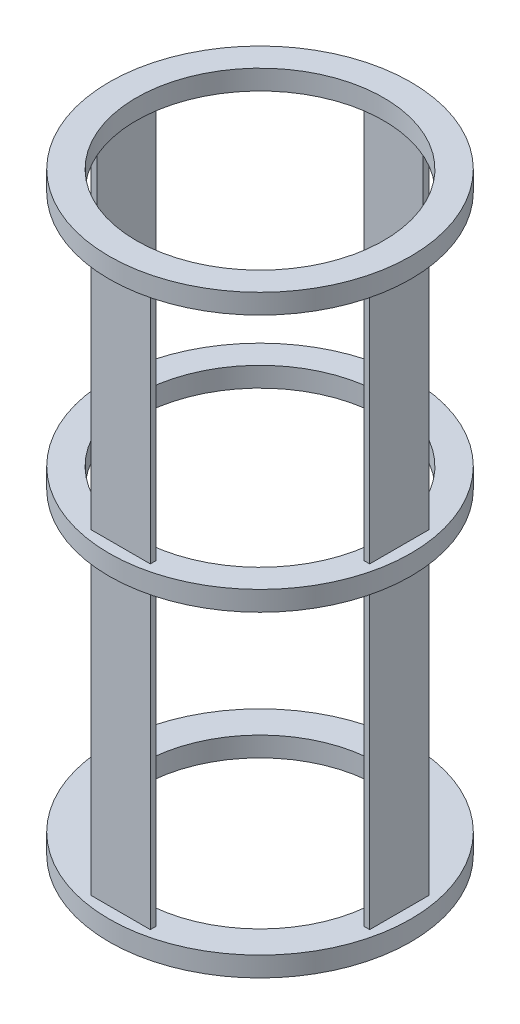
ISO-10303-21;
HEADER;
FILE_DESCRIPTION(('STEP AP214'),'2;1');
FILE_NAME('part.step','',(''),(''),'','','');
FILE_SCHEMA(('AUTOMOTIVE_DESIGN { 1 0 10303 214 1 1 1 1 }'));
ENDSEC;
DATA;
#1=APPLICATION_CONTEXT('core data for automotive mechanical design processes');
#2=APPLICATION_PROTOCOL_DEFINITION('international standard','automotive_design',2000,#1);
#3=PRODUCT_CONTEXT('',#1,'mechanical');
#4=PRODUCT('Part','Part','',(#3));
#5=PRODUCT_RELATED_PRODUCT_CATEGORY('part','',(#4));
#6=PRODUCT_DEFINITION_FORMATION('','',#4);
#7=PRODUCT_DEFINITION_CONTEXT('part definition',#1,'design');
#8=PRODUCT_DEFINITION('design','',#6,#7);
#9=PRODUCT_DEFINITION_SHAPE('','',#8);
#10=(LENGTH_UNIT() NAMED_UNIT(*) SI_UNIT(.MILLI.,.METRE.));
#11=(NAMED_UNIT(*) PLANE_ANGLE_UNIT() SI_UNIT($,.RADIAN.));
#12=(NAMED_UNIT(*) SI_UNIT($,.STERADIAN.) SOLID_ANGLE_UNIT());
#13=UNCERTAINTY_MEASURE_WITH_UNIT(LENGTH_MEASURE(1.E-05),#10,'distance_accuracy_value','');
#14=(GEOMETRIC_REPRESENTATION_CONTEXT(3) GLOBAL_UNCERTAINTY_ASSIGNED_CONTEXT((#13)) GLOBAL_UNIT_ASSIGNED_CONTEXT((#10,
#11,#12)) REPRESENTATION_CONTEXT('',''));
#15=CARTESIAN_POINT('',(0.,0.,0.));
#16=DIRECTION('',(0.,0.,1.));
#17=DIRECTION('',(1.,0.,0.));
#18=AXIS2_PLACEMENT_3D('',#15,#16,#17);
#19=CARTESIAN_POINT('',(70.4201675658329,300.,-15.0000000000007));
#20=DIRECTION('',(-1.,0.,0.));
#21=DIRECTION('',(0.,0.,1.));
#22=AXIS2_PLACEMENT_3D('',#19,#20,#21);
#23=PLANE('',#22);
#24=DIRECTION('',(0.,0.,-1.));
#25=VECTOR('',#24,1.);
#26=CARTESIAN_POINT('',(70.4201675658329,290.,-15.0000000000007));
#27=LINE('',#26,#25);
#28=CARTESIAN_POINT('',(70.4201675658332,290.,14.9999999999993));
#29=VERTEX_POINT('',#28);
#30=CARTESIAN_POINT('',(70.4201675658329,290.,-15.0000000000007));
#31=VERTEX_POINT('',#30);
#32=EDGE_CURVE('E57',#29,#31,#27,.T.);
#33=ORIENTED_EDGE('',*,*,#32,.F.);
#34=DIRECTION('',(0.,-1.,0.));
#35=VECTOR('',#34,1.);
#36=CARTESIAN_POINT('',(70.4201675658332,300.,14.9999999999993));
#37=LINE('',#36,#35);
#38=CARTESIAN_POINT('',(70.4201675658332,170.,14.9999999999993));
#39=VERTEX_POINT('',#38);
#40=EDGE_CURVE('E484',#29,#39,#37,.T.);
#41=ORIENTED_EDGE('',*,*,#40,.T.);
#42=DIRECTION('',(0.,0.,-1.));
#43=VECTOR('',#42,1.);
#44=CARTESIAN_POINT('',(70.4201675658329,170.,-15.0000000000007));
#45=LINE('',#44,#43);
#46=CARTESIAN_POINT('',(70.4201675658329,170.,-15.0000000000007));
#47=VERTEX_POINT('',#46);
#48=EDGE_CURVE('E50',#39,#47,#45,.T.);
#49=ORIENTED_EDGE('',*,*,#48,.T.);
#50=DIRECTION('',(0.,-1.,0.));
#51=VECTOR('',#50,1.);
#52=CARTESIAN_POINT('',(70.4201675658329,300.,-15.0000000000007));
#53=LINE('',#52,#51);
#54=EDGE_CURVE('E480',#31,#47,#53,.T.);
#55=ORIENTED_EDGE('',*,*,#54,.F.);
#56=EDGE_LOOP('',(#33,#41,#49,#55));
#57=FACE_BOUND('',#56,.T.);
#58=ADVANCED_FACE('F41',(#57),#23,.F.);
#59=CARTESIAN_POINT('',(70.4201675658332,300.,14.9999999999993));
#60=DIRECTION('',(0.,0.,-1.));
#61=DIRECTION('',(-1.,0.,0.));
#62=AXIS2_PLACEMENT_3D('',#59,#60,#61);
#63=PLANE('',#62);
#64=DIRECTION('',(1.,0.,0.));
#65=VECTOR('',#64,1.);
#66=CARTESIAN_POINT('',(70.4201675658332,290.,14.9999999999993));
#67=LINE('',#66,#65);
#68=CARTESIAN_POINT('',(67.4201675658332,290.,14.9999999999993));
#69=VERTEX_POINT('',#68);
#70=EDGE_CURVE('E64',#69,#29,#67,.T.);
#71=ORIENTED_EDGE('',*,*,#70,.F.);
#72=DIRECTION('',(0.,-1.,0.));
#73=VECTOR('',#72,1.);
#74=CARTESIAN_POINT('',(67.4201675658332,300.,14.9999999999993));
#75=LINE('',#74,#73);
#76=CARTESIAN_POINT('',(67.4201675658332,170.,14.9999999999993));
#77=VERTEX_POINT('',#76);
#78=EDGE_CURVE('E488',#69,#77,#75,.T.);
#79=ORIENTED_EDGE('',*,*,#78,.T.);
#80=DIRECTION('',(1.,0.,0.));
#81=VECTOR('',#80,1.);
#82=CARTESIAN_POINT('',(70.4201675658332,170.,14.9999999999993));
#83=LINE('',#82,#81);
#84=EDGE_CURVE('E406',#77,#39,#83,.T.);
#85=ORIENTED_EDGE('',*,*,#84,.T.);
#86=ORIENTED_EDGE('',*,*,#40,.F.);
#87=EDGE_LOOP('',(#71,#79,#85,#86));
#88=FACE_BOUND('',#87,.T.);
#89=ADVANCED_FACE('F613',(#88),#63,.F.);
#90=CARTESIAN_POINT('',(67.4201675658332,300.,14.9999999999993));
#91=DIRECTION('',(1.,0.,0.));
#92=DIRECTION('',(0.,0.,-1.));
#93=AXIS2_PLACEMENT_3D('',#90,#91,#92);
#94=PLANE('',#93);
#95=DIRECTION('',(0.,0.,1.));
#96=VECTOR('',#95,1.);
#97=CARTESIAN_POINT('',(67.4201675658332,290.,14.9999999999993));
#98=LINE('',#97,#96);
#99=CARTESIAN_POINT('',(67.4201675658329,290.,-15.0000000000007));
#100=VERTEX_POINT('',#99);
#101=EDGE_CURVE('E322',#100,#69,#98,.T.);
#102=ORIENTED_EDGE('',*,*,#101,.F.);
#103=DIRECTION('',(0.,-1.,0.));
#104=VECTOR('',#103,1.);
#105=CARTESIAN_POINT('',(67.4201675658329,300.,-15.0000000000007));
#106=LINE('',#105,#104);
#107=CARTESIAN_POINT('',(67.4201675658328,170.,-15.0000000000007));
#108=VERTEX_POINT('',#107);
#109=EDGE_CURVE('E492',#100,#108,#106,.T.);
#110=ORIENTED_EDGE('',*,*,#109,.T.);
#111=DIRECTION('',(0.,0.,1.));
#112=VECTOR('',#111,1.);
#113=CARTESIAN_POINT('',(67.4201675658332,170.,14.9999999999993));
#114=LINE('',#113,#112);
#115=EDGE_CURVE('E410',#108,#77,#114,.T.);
#116=ORIENTED_EDGE('',*,*,#115,.T.);
#117=ORIENTED_EDGE('',*,*,#78,.F.);
#118=EDGE_LOOP('',(#102,#110,#116,#117));
#119=FACE_BOUND('',#118,.T.);
#120=ADVANCED_FACE('F616',(#119),#94,.F.);
#121=CARTESIAN_POINT('',(67.4201675658329,300.,-15.0000000000007));
#122=DIRECTION('',(0.,0.,1.));
#123=DIRECTION('',(1.,0.,0.));
#124=AXIS2_PLACEMENT_3D('',#121,#122,#123);
#125=PLANE('',#124);
#126=DIRECTION('',(-1.,0.,0.));
#127=VECTOR('',#126,1.);
#128=CARTESIAN_POINT('',(67.4201675658329,290.,-15.0000000000007));
#129=LINE('',#128,#127);
#130=EDGE_CURVE('E318',#31,#100,#129,.T.);
#131=ORIENTED_EDGE('',*,*,#130,.F.);
#132=ORIENTED_EDGE('',*,*,#54,.T.);
#133=DIRECTION('',(-1.,0.,0.));
#134=VECTOR('',#133,1.);
#135=CARTESIAN_POINT('',(67.4201675658329,170.,-15.0000000000007));
#136=LINE('',#135,#134);
#137=EDGE_CURVE('E414',#47,#108,#136,.T.);
#138=ORIENTED_EDGE('',*,*,#137,.T.);
#139=ORIENTED_EDGE('',*,*,#109,.F.);
#140=EDGE_LOOP('',(#131,#132,#138,#139));
#141=FACE_BOUND('',#140,.T.);
#142=ADVANCED_FACE('F619',(#141),#125,.F.);
#143=CARTESIAN_POINT('',(15.,300.,70.420167565833));
#144=DIRECTION('',(0.,0.,-1.));
#145=DIRECTION('',(-1.,0.,0.));
#146=AXIS2_PLACEMENT_3D('',#143,#144,#145);
#147=PLANE('',#146);
#148=DIRECTION('',(1.,0.,0.));
#149=VECTOR('',#148,1.);
#150=CARTESIAN_POINT('',(15.,290.,70.420167565833));
#151=LINE('',#150,#149);
#152=CARTESIAN_POINT('',(-15.,290.,70.420167565833));
#153=VERTEX_POINT('',#152);
#154=CARTESIAN_POINT('',(15.,290.,70.420167565833));
#155=VERTEX_POINT('',#154);
#156=EDGE_CURVE('E314',#153,#155,#151,.T.);
#157=ORIENTED_EDGE('',*,*,#156,.F.);
#158=DIRECTION('',(0.,-1.,0.));
#159=VECTOR('',#158,1.);
#160=CARTESIAN_POINT('',(-15.,300.,70.420167565833));
#161=LINE('',#160,#159);
#162=CARTESIAN_POINT('',(-15.,170.,70.420167565833));
#163=VERTEX_POINT('',#162);
#164=EDGE_CURVE('E516',#153,#163,#161,.T.);
#165=ORIENTED_EDGE('',*,*,#164,.T.);
#166=DIRECTION('',(1.,0.,0.));
#167=VECTOR('',#166,1.);
#168=CARTESIAN_POINT('',(15.,170.,70.420167565833));
#169=LINE('',#168,#167);
#170=CARTESIAN_POINT('',(15.,170.,70.420167565833));
#171=VERTEX_POINT('',#170);
#172=EDGE_CURVE('E418',#163,#171,#169,.T.);
#173=ORIENTED_EDGE('',*,*,#172,.T.);
#174=DIRECTION('',(0.,-1.,0.));
#175=VECTOR('',#174,1.);
#176=CARTESIAN_POINT('',(15.,300.,70.420167565833));
#177=LINE('',#176,#175);
#178=EDGE_CURVE('E512',#155,#171,#177,.T.);
#179=ORIENTED_EDGE('',*,*,#178,.F.);
#180=EDGE_LOOP('',(#157,#165,#173,#179));
#181=FACE_BOUND('',#180,.T.);
#182=ADVANCED_FACE('F621',(#181),#147,.F.);
#183=CARTESIAN_POINT('',(-15.,300.,70.420167565833));
#184=DIRECTION('',(1.,0.,0.));
#185=DIRECTION('',(0.,0.,-1.));
#186=AXIS2_PLACEMENT_3D('',#183,#184,#185);
#187=PLANE('',#186);
#188=DIRECTION('',(0.,0.,1.));
#189=VECTOR('',#188,1.);
#190=CARTESIAN_POINT('',(-15.,290.,70.420167565833));
#191=LINE('',#190,#189);
#192=CARTESIAN_POINT('',(-15.,290.,67.420167565833));
#193=VERTEX_POINT('',#192);
#194=EDGE_CURVE('E310',#193,#153,#191,.T.);
#195=ORIENTED_EDGE('',*,*,#194,.F.);
#196=DIRECTION('',(0.,-1.,0.));
#197=VECTOR('',#196,1.);
#198=CARTESIAN_POINT('',(-15.,300.,67.420167565833));
#199=LINE('',#198,#197);
#200=CARTESIAN_POINT('',(-15.,170.,67.420167565833));
#201=VERTEX_POINT('',#200);
#202=EDGE_CURVE('E520',#193,#201,#199,.T.);
#203=ORIENTED_EDGE('',*,*,#202,.T.);
#204=DIRECTION('',(0.,0.,1.));
#205=VECTOR('',#204,1.);
#206=CARTESIAN_POINT('',(-15.,170.,70.420167565833));
#207=LINE('',#206,#205);
#208=EDGE_CURVE('E422',#201,#163,#207,.T.);
#209=ORIENTED_EDGE('',*,*,#208,.T.);
#210=ORIENTED_EDGE('',*,*,#164,.F.);
#211=EDGE_LOOP('',(#195,#203,#209,#210));
#212=FACE_BOUND('',#211,.T.);
#213=ADVANCED_FACE('F628',(#212),#187,.F.);
#214=CARTESIAN_POINT('',(-15.,300.,67.420167565833));
#215=DIRECTION('',(0.,0.,1.));
#216=DIRECTION('',(1.,0.,0.));
#217=AXIS2_PLACEMENT_3D('',#214,#215,#216);
#218=PLANE('',#217);
#219=DIRECTION('',(-1.,0.,0.));
#220=VECTOR('',#219,1.);
#221=CARTESIAN_POINT('',(-15.,290.,67.420167565833));
#222=LINE('',#221,#220);
#223=CARTESIAN_POINT('',(15.,290.,67.420167565833));
#224=VERTEX_POINT('',#223);
#225=EDGE_CURVE('E306',#224,#193,#222,.T.);
#226=ORIENTED_EDGE('',*,*,#225,.F.);
#227=DIRECTION('',(0.,-1.,0.));
#228=VECTOR('',#227,1.);
#229=CARTESIAN_POINT('',(15.,300.,67.420167565833));
#230=LINE('',#229,#228);
#231=CARTESIAN_POINT('',(15.,170.,67.420167565833));
#232=VERTEX_POINT('',#231);
#233=EDGE_CURVE('E524',#224,#232,#230,.T.);
#234=ORIENTED_EDGE('',*,*,#233,.T.);
#235=DIRECTION('',(-1.,0.,0.));
#236=VECTOR('',#235,1.);
#237=CARTESIAN_POINT('',(-15.,170.,67.420167565833));
#238=LINE('',#237,#236);
#239=EDGE_CURVE('E426',#232,#201,#238,.T.);
#240=ORIENTED_EDGE('',*,*,#239,.T.);
#241=ORIENTED_EDGE('',*,*,#202,.F.);
#242=EDGE_LOOP('',(#226,#234,#240,#241));
#243=FACE_BOUND('',#242,.T.);
#244=ADVANCED_FACE('F814',(#243),#218,.F.);
#245=CARTESIAN_POINT('',(15.,300.,67.420167565833));
#246=DIRECTION('',(-1.,0.,0.));
#247=DIRECTION('',(0.,0.,1.));
#248=AXIS2_PLACEMENT_3D('',#245,#246,#247);
#249=PLANE('',#248);
#250=DIRECTION('',(0.,0.,-1.));
#251=VECTOR('',#250,1.);
#252=CARTESIAN_POINT('',(15.,290.,67.420167565833));
#253=LINE('',#252,#251);
#254=EDGE_CURVE('E302',#155,#224,#253,.T.);
#255=ORIENTED_EDGE('',*,*,#254,.F.);
#256=ORIENTED_EDGE('',*,*,#178,.T.);
#257=DIRECTION('',(0.,0.,-1.));
#258=VECTOR('',#257,1.);
#259=CARTESIAN_POINT('',(15.,170.,67.420167565833));
#260=LINE('',#259,#258);
#261=EDGE_CURVE('E430',#171,#232,#260,.T.);
#262=ORIENTED_EDGE('',*,*,#261,.T.);
#263=ORIENTED_EDGE('',*,*,#233,.F.);
#264=EDGE_LOOP('',(#255,#256,#262,#263));
#265=FACE_BOUND('',#264,.T.);
#266=ADVANCED_FACE('F815',(#265),#249,.F.);
#267=CARTESIAN_POINT('',(-70.420167565833,300.,15.0000000000002));
#268=DIRECTION('',(1.,0.,0.));
#269=DIRECTION('',(0.,0.,-1.));
#270=AXIS2_PLACEMENT_3D('',#267,#268,#269);
#271=PLANE('',#270);
#272=DIRECTION('',(0.,0.,1.));
#273=VECTOR('',#272,1.);
#274=CARTESIAN_POINT('',(-70.420167565833,290.,15.0000000000002));
#275=LINE('',#274,#273);
#276=CARTESIAN_POINT('',(-70.4201675658331,290.,-14.9999999999998));
#277=VERTEX_POINT('',#276);
#278=CARTESIAN_POINT('',(-70.420167565833,290.,15.0000000000002));
#279=VERTEX_POINT('',#278);
#280=EDGE_CURVE('E298',#277,#279,#275,.T.);
#281=ORIENTED_EDGE('',*,*,#280,.F.);
#282=DIRECTION('',(0.,-1.,0.));
#283=VECTOR('',#282,1.);
#284=CARTESIAN_POINT('',(-70.4201675658331,300.,-14.9999999999998));
#285=LINE('',#284,#283);
#286=CARTESIAN_POINT('',(-70.4201675658331,170.,-14.9999999999998));
#287=VERTEX_POINT('',#286);
#288=EDGE_CURVE('E548',#277,#287,#285,.T.);
#289=ORIENTED_EDGE('',*,*,#288,.T.);
#290=DIRECTION('',(0.,0.,1.));
#291=VECTOR('',#290,1.);
#292=CARTESIAN_POINT('',(-70.420167565833,170.,15.0000000000002));
#293=LINE('',#292,#291);
#294=CARTESIAN_POINT('',(-70.420167565833,170.,15.0000000000002));
#295=VERTEX_POINT('',#294);
#296=EDGE_CURVE('E434',#287,#295,#293,.T.);
#297=ORIENTED_EDGE('',*,*,#296,.T.);
#298=DIRECTION('',(0.,-1.,0.));
#299=VECTOR('',#298,1.);
#300=CARTESIAN_POINT('',(-70.420167565833,300.,15.0000000000002));
#301=LINE('',#300,#299);
#302=EDGE_CURVE('E544',#279,#295,#301,.T.);
#303=ORIENTED_EDGE('',*,*,#302,.F.);
#304=EDGE_LOOP('',(#281,#289,#297,#303));
#305=FACE_BOUND('',#304,.T.);
#306=ADVANCED_FACE('F817',(#305),#271,.F.);
#307=CARTESIAN_POINT('',(-70.4201675658331,300.,-14.9999999999998));
#308=DIRECTION('',(0.,0.,1.));
#309=DIRECTION('',(1.,0.,0.));
#310=AXIS2_PLACEMENT_3D('',#307,#308,#309);
#311=PLANE('',#310);
#312=DIRECTION('',(-1.,0.,0.));
#313=VECTOR('',#312,1.);
#314=CARTESIAN_POINT('',(-70.4201675658331,290.,-14.9999999999998));
#315=LINE('',#314,#313);
#316=CARTESIAN_POINT('',(-67.4201675658331,290.,-14.9999999999998));
#317=VERTEX_POINT('',#316);
#318=EDGE_CURVE('E294',#317,#277,#315,.T.);
#319=ORIENTED_EDGE('',*,*,#318,.F.);
#320=DIRECTION('',(0.,-1.,0.));
#321=VECTOR('',#320,1.);
#322=CARTESIAN_POINT('',(-67.4201675658331,300.,-14.9999999999998));
#323=LINE('',#322,#321);
#324=CARTESIAN_POINT('',(-67.4201675658331,170.,-14.9999999999998));
#325=VERTEX_POINT('',#324);
#326=EDGE_CURVE('E552',#317,#325,#323,.T.);
#327=ORIENTED_EDGE('',*,*,#326,.T.);
#328=DIRECTION('',(-1.,0.,0.));
#329=VECTOR('',#328,1.);
#330=CARTESIAN_POINT('',(-70.4201675658331,170.,-14.9999999999998));
#331=LINE('',#330,#329);
#332=EDGE_CURVE('E438',#325,#287,#331,.T.);
#333=ORIENTED_EDGE('',*,*,#332,.T.);
#334=ORIENTED_EDGE('',*,*,#288,.F.);
#335=EDGE_LOOP('',(#319,#327,#333,#334));
#336=FACE_BOUND('',#335,.T.);
#337=ADVANCED_FACE('F730',(#336),#311,.F.);
#338=CARTESIAN_POINT('',(-67.4201675658331,300.,-14.9999999999998));
#339=DIRECTION('',(-1.,0.,0.));
#340=DIRECTION('',(0.,0.,1.));
#341=AXIS2_PLACEMENT_3D('',#338,#339,#340);
#342=PLANE('',#341);
#343=DIRECTION('',(0.,0.,-1.));
#344=VECTOR('',#343,1.);
#345=CARTESIAN_POINT('',(-67.4201675658331,290.,-14.9999999999998));
#346=LINE('',#345,#344);
#347=CARTESIAN_POINT('',(-67.420167565833,290.,15.0000000000002));
#348=VERTEX_POINT('',#347);
#349=EDGE_CURVE('E287',#348,#317,#346,.T.);
#350=ORIENTED_EDGE('',*,*,#349,.F.);
#351=DIRECTION('',(0.,-1.,0.));
#352=VECTOR('',#351,1.);
#353=CARTESIAN_POINT('',(-67.420167565833,300.,15.0000000000002));
#354=LINE('',#353,#352);
#355=CARTESIAN_POINT('',(-67.420167565833,170.,15.0000000000002));
#356=VERTEX_POINT('',#355);
#357=EDGE_CURVE('E556',#348,#356,#354,.T.);
#358=ORIENTED_EDGE('',*,*,#357,.T.);
#359=DIRECTION('',(0.,0.,-1.));
#360=VECTOR('',#359,1.);
#361=CARTESIAN_POINT('',(-67.4201675658331,170.,-14.9999999999998));
#362=LINE('',#361,#360);
#363=EDGE_CURVE('E442',#356,#325,#362,.T.);
#364=ORIENTED_EDGE('',*,*,#363,.T.);
#365=ORIENTED_EDGE('',*,*,#326,.F.);
#366=EDGE_LOOP('',(#350,#358,#364,#365));
#367=FACE_BOUND('',#366,.T.);
#368=ADVANCED_FACE('F725',(#367),#342,.F.);
#369=CARTESIAN_POINT('',(-67.420167565833,300.,15.0000000000002));
#370=DIRECTION('',(0.,0.,-1.));
#371=DIRECTION('',(-1.,0.,0.));
#372=AXIS2_PLACEMENT_3D('',#369,#370,#371);
#373=PLANE('',#372);
#374=DIRECTION('',(1.,0.,0.));
#375=VECTOR('',#374,1.);
#376=CARTESIAN_POINT('',(-67.420167565833,290.,15.0000000000002));
#377=LINE('',#376,#375);
#378=EDGE_CURVE('E282',#279,#348,#377,.T.);
#379=ORIENTED_EDGE('',*,*,#378,.F.);
#380=ORIENTED_EDGE('',*,*,#302,.T.);
#381=DIRECTION('',(1.,0.,0.));
#382=VECTOR('',#381,1.);
#383=CARTESIAN_POINT('',(-67.420167565833,170.,15.0000000000002));
#384=LINE('',#383,#382);
#385=EDGE_CURVE('E446',#295,#356,#384,.T.);
#386=ORIENTED_EDGE('',*,*,#385,.T.);
#387=ORIENTED_EDGE('',*,*,#357,.F.);
#388=EDGE_LOOP('',(#379,#380,#386,#387));
#389=FACE_BOUND('',#388,.T.);
#390=ADVANCED_FACE('F715',(#389),#373,.F.);
#391=CARTESIAN_POINT('',(-15.,300.,-70.420167565833));
#392=DIRECTION('',(0.,0.,1.));
#393=DIRECTION('',(1.,0.,0.));
#394=AXIS2_PLACEMENT_3D('',#391,#392,#393);
#395=PLANE('',#394);
#396=DIRECTION('',(-1.,0.,0.));
#397=VECTOR('',#396,1.);
#398=CARTESIAN_POINT('',(-15.,290.,-70.420167565833));
#399=LINE('',#398,#397);
#400=CARTESIAN_POINT('',(15.,290.,-70.420167565833));
#401=VERTEX_POINT('',#400);
#402=CARTESIAN_POINT('',(-15.,290.,-70.420167565833));
#403=VERTEX_POINT('',#402);
#404=EDGE_CURVE('E278',#401,#403,#399,.T.);
#405=ORIENTED_EDGE('',*,*,#404,.F.);
#406=DIRECTION('',(0.,-1.,0.));
#407=VECTOR('',#406,1.);
#408=CARTESIAN_POINT('',(15.,300.,-70.420167565833));
#409=LINE('',#408,#407);
#410=CARTESIAN_POINT('',(15.,170.,-70.420167565833));
#411=VERTEX_POINT('',#410);
#412=EDGE_CURVE('E580',#401,#411,#409,.T.);
#413=ORIENTED_EDGE('',*,*,#412,.T.);
#414=DIRECTION('',(-1.,0.,0.));
#415=VECTOR('',#414,1.);
#416=CARTESIAN_POINT('',(-15.,170.,-70.420167565833));
#417=LINE('',#416,#415);
#418=CARTESIAN_POINT('',(-15.,170.,-70.420167565833));
#419=VERTEX_POINT('',#418);
#420=EDGE_CURVE('E450',#411,#419,#417,.T.);
#421=ORIENTED_EDGE('',*,*,#420,.T.);
#422=DIRECTION('',(0.,-1.,0.));
#423=VECTOR('',#422,1.);
#424=CARTESIAN_POINT('',(-15.,300.,-70.420167565833));
#425=LINE('',#424,#423);
#426=EDGE_CURVE('E576',#403,#419,#425,.T.);
#427=ORIENTED_EDGE('',*,*,#426,.F.);
#428=EDGE_LOOP('',(#405,#413,#421,#427));
#429=FACE_BOUND('',#428,.T.);
#430=ADVANCED_FACE('F707',(#429),#395,.F.);
#431=CARTESIAN_POINT('',(15.,300.,-70.420167565833));
#432=DIRECTION('',(-1.,0.,0.));
#433=DIRECTION('',(0.,0.,1.));
#434=AXIS2_PLACEMENT_3D('',#431,#432,#433);
#435=PLANE('',#434);
#436=DIRECTION('',(0.,0.,-1.));
#437=VECTOR('',#436,1.);
#438=CARTESIAN_POINT('',(15.,290.,-70.420167565833));
#439=LINE('',#438,#437);
#440=CARTESIAN_POINT('',(15.,290.,-67.420167565833));
#441=VERTEX_POINT('',#440);
#442=EDGE_CURVE('E272',#441,#401,#439,.T.);
#443=ORIENTED_EDGE('',*,*,#442,.F.);
#444=DIRECTION('',(0.,-1.,0.));
#445=VECTOR('',#444,1.);
#446=CARTESIAN_POINT('',(15.,300.,-67.420167565833));
#447=LINE('',#446,#445);
#448=CARTESIAN_POINT('',(15.,170.,-67.420167565833));
#449=VERTEX_POINT('',#448);
#450=EDGE_CURVE('E268',#441,#449,#447,.T.);
#451=ORIENTED_EDGE('',*,*,#450,.T.);
#452=DIRECTION('',(0.,0.,-1.));
#453=VECTOR('',#452,1.);
#454=CARTESIAN_POINT('',(15.,170.,-70.420167565833));
#455=LINE('',#454,#453);
#456=EDGE_CURVE('E454',#449,#411,#455,.T.);
#457=ORIENTED_EDGE('',*,*,#456,.T.);
#458=ORIENTED_EDGE('',*,*,#412,.F.);
#459=EDGE_LOOP('',(#443,#451,#457,#458));
#460=FACE_BOUND('',#459,.T.);
#461=ADVANCED_FACE('F717',(#460),#435,.F.);
#462=CARTESIAN_POINT('',(15.,300.,-67.420167565833));
#463=DIRECTION('',(0.,0.,-1.));
#464=DIRECTION('',(-1.,0.,0.));
#465=AXIS2_PLACEMENT_3D('',#462,#463,#464);
#466=PLANE('',#465);
#467=DIRECTION('',(1.,0.,0.));
#468=VECTOR('',#467,1.);
#469=CARTESIAN_POINT('',(15.,290.,-67.420167565833));
#470=LINE('',#469,#468);
#471=CARTESIAN_POINT('',(-15.,290.,-67.420167565833));
#472=VERTEX_POINT('',#471);
#473=EDGE_CURVE('E266',#472,#441,#470,.T.);
#474=ORIENTED_EDGE('',*,*,#473,.F.);
#475=DIRECTION('',(0.,-1.,0.));
#476=VECTOR('',#475,1.);
#477=CARTESIAN_POINT('',(-15.,300.,-67.420167565833));
#478=LINE('',#477,#476);
#479=CARTESIAN_POINT('',(-15.,170.,-67.420167565833));
#480=VERTEX_POINT('',#479);
#481=EDGE_CURVE('E251',#472,#480,#478,.T.);
#482=ORIENTED_EDGE('',*,*,#481,.T.);
#483=DIRECTION('',(1.,0.,0.));
#484=VECTOR('',#483,1.);
#485=CARTESIAN_POINT('',(15.,170.,-67.420167565833));
#486=LINE('',#485,#484);
#487=EDGE_CURVE('E458',#480,#449,#486,.T.);
#488=ORIENTED_EDGE('',*,*,#487,.T.);
#489=ORIENTED_EDGE('',*,*,#450,.F.);
#490=EDGE_LOOP('',(#474,#482,#488,#489));
#491=FACE_BOUND('',#490,.T.);
#492=ADVANCED_FACE('F267',(#491),#466,.F.);
#493=CARTESIAN_POINT('',(-15.,300.,-67.420167565833));
#494=DIRECTION('',(1.,0.,0.));
#495=DIRECTION('',(0.,0.,-1.));
#496=AXIS2_PLACEMENT_3D('',#493,#494,#495);
#497=PLANE('',#496);
#498=DIRECTION('',(0.,0.,1.));
#499=VECTOR('',#498,1.);
#500=CARTESIAN_POINT('',(-15.,290.,-67.420167565833));
#501=LINE('',#500,#499);
#502=EDGE_CURVE('E11',#403,#472,#501,.T.);
#503=ORIENTED_EDGE('',*,*,#502,.F.);
#504=ORIENTED_EDGE('',*,*,#426,.T.);
#505=DIRECTION('',(0.,0.,1.));
#506=VECTOR('',#505,1.);
#507=CARTESIAN_POINT('',(-15.,170.,-67.420167565833));
#508=LINE('',#507,#506);
#509=EDGE_CURVE('E256',#419,#480,#508,.T.);
#510=ORIENTED_EDGE('',*,*,#509,.T.);
#511=ORIENTED_EDGE('',*,*,#481,.F.);
#512=EDGE_LOOP('',(#503,#504,#510,#511));
#513=FACE_BOUND('',#512,.T.);
#514=ADVANCED_FACE('F253',(#513),#497,.F.);
#515=DIRECTION('',(0.,0.,1.));
#516=VECTOR('',#515,1.);
#517=CARTESIAN_POINT('',(-15.,160.,-67.420167565833));
#518=LINE('',#517,#516);
#519=CARTESIAN_POINT('',(-15.,160.,-70.420167565833));
#520=VERTEX_POINT('',#519);
#521=CARTESIAN_POINT('',(-15.,160.,-67.420167565833));
#522=VERTEX_POINT('',#521);
#523=EDGE_CURVE('E402',#520,#522,#518,.T.);
#524=ORIENTED_EDGE('',*,*,#523,.F.);
#525=CARTESIAN_POINT('',(-15.,10.,-70.420167565833));
#526=VERTEX_POINT('',#525);
#527=EDGE_CURVE('E575',#520,#526,#425,.T.);
#528=ORIENTED_EDGE('',*,*,#527,.T.);
#529=DIRECTION('',(0.,0.,1.));
#530=VECTOR('',#529,1.);
#531=CARTESIAN_POINT('',(-15.,10.,-67.420167565833));
#532=LINE('',#531,#530);
#533=CARTESIAN_POINT('',(-15.,10.,-67.420167565833));
#534=VERTEX_POINT('',#533);
#535=EDGE_CURVE('E559',#526,#534,#532,.T.);
#536=ORIENTED_EDGE('',*,*,#535,.T.);
#537=EDGE_CURVE('E262',#522,#534,#478,.T.);
#538=ORIENTED_EDGE('',*,*,#537,.F.);
#539=EDGE_LOOP('',(#524,#528,#536,#538));
#540=FACE_BOUND('',#539,.T.);
#541=ADVANCED_FACE('F694',(#540),#497,.F.);
#542=DIRECTION('',(1.,0.,0.));
#543=VECTOR('',#542,1.);
#544=CARTESIAN_POINT('',(15.,160.,-67.420167565833));
#545=LINE('',#544,#543);
#546=CARTESIAN_POINT('',(15.,160.,-67.420167565833));
#547=VERTEX_POINT('',#546);
#548=EDGE_CURVE('E398',#522,#547,#545,.T.);
#549=ORIENTED_EDGE('',*,*,#548,.F.);
#550=ORIENTED_EDGE('',*,*,#537,.T.);
#551=DIRECTION('',(1.,0.,0.));
#552=VECTOR('',#551,1.);
#553=CARTESIAN_POINT('',(15.,10.,-67.420167565833));
#554=LINE('',#553,#552);
#555=CARTESIAN_POINT('',(15.,10.,-67.420167565833));
#556=VERTEX_POINT('',#555);
#557=EDGE_CURVE('E563',#534,#556,#554,.T.);
#558=ORIENTED_EDGE('',*,*,#557,.T.);
#559=EDGE_CURVE('E583',#547,#556,#447,.T.);
#560=ORIENTED_EDGE('',*,*,#559,.F.);
#561=EDGE_LOOP('',(#549,#550,#558,#560));
#562=FACE_BOUND('',#561,.T.);
#563=ADVANCED_FACE('F687',(#562),#466,.F.);
#564=DIRECTION('',(0.,0.,-1.));
#565=VECTOR('',#564,1.);
#566=CARTESIAN_POINT('',(15.,160.,-70.420167565833));
#567=LINE('',#566,#565);
#568=CARTESIAN_POINT('',(15.,160.,-70.420167565833));
#569=VERTEX_POINT('',#568);
#570=EDGE_CURVE('E394',#547,#569,#567,.T.);
#571=ORIENTED_EDGE('',*,*,#570,.F.);
#572=ORIENTED_EDGE('',*,*,#559,.T.);
#573=DIRECTION('',(0.,0.,-1.));
#574=VECTOR('',#573,1.);
#575=CARTESIAN_POINT('',(15.,10.,-70.420167565833));
#576=LINE('',#575,#574);
#577=CARTESIAN_POINT('',(15.,10.,-70.420167565833));
#578=VERTEX_POINT('',#577);
#579=EDGE_CURVE('E567',#556,#578,#576,.T.);
#580=ORIENTED_EDGE('',*,*,#579,.T.);
#581=EDGE_CURVE('E579',#569,#578,#409,.T.);
#582=ORIENTED_EDGE('',*,*,#581,.F.);
#583=EDGE_LOOP('',(#571,#572,#580,#582));
#584=FACE_BOUND('',#583,.T.);
#585=ADVANCED_FACE('F700',(#584),#435,.F.);
#586=DIRECTION('',(-1.,0.,0.));
#587=VECTOR('',#586,1.);
#588=CARTESIAN_POINT('',(-15.,160.,-70.420167565833));
#589=LINE('',#588,#587);
#590=EDGE_CURVE('E390',#569,#520,#589,.T.);
#591=ORIENTED_EDGE('',*,*,#590,.F.);
#592=ORIENTED_EDGE('',*,*,#581,.T.);
#593=DIRECTION('',(-1.,0.,0.));
#594=VECTOR('',#593,1.);
#595=CARTESIAN_POINT('',(-15.,10.,-70.420167565833));
#596=LINE('',#595,#594);
#597=EDGE_CURVE('E571',#578,#526,#596,.T.);
#598=ORIENTED_EDGE('',*,*,#597,.T.);
#599=ORIENTED_EDGE('',*,*,#527,.F.);
#600=EDGE_LOOP('',(#591,#592,#598,#599));
#601=FACE_BOUND('',#600,.T.);
#602=ADVANCED_FACE('F703',(#601),#395,.F.);
#603=DIRECTION('',(1.,0.,0.));
#604=VECTOR('',#603,1.);
#605=CARTESIAN_POINT('',(-67.420167565833,160.,15.0000000000002));
#606=LINE('',#605,#604);
#607=CARTESIAN_POINT('',(-70.420167565833,160.,15.0000000000002));
#608=VERTEX_POINT('',#607);
#609=CARTESIAN_POINT('',(-67.420167565833,160.,15.0000000000002));
#610=VERTEX_POINT('',#609);
#611=EDGE_CURVE('E386',#608,#610,#606,.T.);
#612=ORIENTED_EDGE('',*,*,#611,.F.);
#613=CARTESIAN_POINT('',(-70.420167565833,10.,15.0000000000002));
#614=VERTEX_POINT('',#613);
#615=EDGE_CURVE('E543',#608,#614,#301,.T.);
#616=ORIENTED_EDGE('',*,*,#615,.T.);
#617=DIRECTION('',(1.,0.,0.));
#618=VECTOR('',#617,1.);
#619=CARTESIAN_POINT('',(-67.420167565833,10.,15.0000000000002));
#620=LINE('',#619,#618);
#621=CARTESIAN_POINT('',(-67.420167565833,10.,15.0000000000002));
#622=VERTEX_POINT('',#621);
#623=EDGE_CURVE('E527',#614,#622,#620,.T.);
#624=ORIENTED_EDGE('',*,*,#623,.T.);
#625=EDGE_CURVE('E555',#610,#622,#354,.T.);
#626=ORIENTED_EDGE('',*,*,#625,.F.);
#627=EDGE_LOOP('',(#612,#616,#624,#626));
#628=FACE_BOUND('',#627,.T.);
#629=ADVANCED_FACE('F705',(#628),#373,.F.);
#630=DIRECTION('',(0.,0.,-1.));
#631=VECTOR('',#630,1.);
#632=CARTESIAN_POINT('',(-67.4201675658331,160.,-14.9999999999998));
#633=LINE('',#632,#631);
#634=CARTESIAN_POINT('',(-67.4201675658331,160.,-14.9999999999998));
#635=VERTEX_POINT('',#634);
#636=EDGE_CURVE('E382',#610,#635,#633,.T.);
#637=ORIENTED_EDGE('',*,*,#636,.F.);
#638=ORIENTED_EDGE('',*,*,#625,.T.);
#639=DIRECTION('',(0.,0.,-1.));
#640=VECTOR('',#639,1.);
#641=CARTESIAN_POINT('',(-67.4201675658331,10.,-14.9999999999998));
#642=LINE('',#641,#640);
#643=CARTESIAN_POINT('',(-67.4201675658331,10.,-14.9999999999998));
#644=VERTEX_POINT('',#643);
#645=EDGE_CURVE('E531',#622,#644,#642,.T.);
#646=ORIENTED_EDGE('',*,*,#645,.T.);
#647=EDGE_CURVE('E551',#635,#644,#323,.T.);
#648=ORIENTED_EDGE('',*,*,#647,.F.);
#649=EDGE_LOOP('',(#637,#638,#646,#648));
#650=FACE_BOUND('',#649,.T.);
#651=ADVANCED_FACE('F712',(#650),#342,.F.);
#652=DIRECTION('',(-1.,0.,0.));
#653=VECTOR('',#652,1.);
#654=CARTESIAN_POINT('',(-70.4201675658331,160.,-14.9999999999998));
#655=LINE('',#654,#653);
#656=CARTESIAN_POINT('',(-70.4201675658331,160.,-14.9999999999998));
#657=VERTEX_POINT('',#656);
#658=EDGE_CURVE('E378',#635,#657,#655,.T.);
#659=ORIENTED_EDGE('',*,*,#658,.F.);
#660=ORIENTED_EDGE('',*,*,#647,.T.);
#661=DIRECTION('',(-1.,0.,0.));
#662=VECTOR('',#661,1.);
#663=CARTESIAN_POINT('',(-70.4201675658331,10.,-14.9999999999998));
#664=LINE('',#663,#662);
#665=CARTESIAN_POINT('',(-70.4201675658331,10.,-14.9999999999998));
#666=VERTEX_POINT('',#665);
#667=EDGE_CURVE('E535',#644,#666,#664,.T.);
#668=ORIENTED_EDGE('',*,*,#667,.T.);
#669=EDGE_CURVE('E547',#657,#666,#285,.T.);
#670=ORIENTED_EDGE('',*,*,#669,.F.);
#671=EDGE_LOOP('',(#659,#660,#668,#670));
#672=FACE_BOUND('',#671,.T.);
#673=ADVANCED_FACE('F837',(#672),#311,.F.);
#674=DIRECTION('',(0.,0.,1.));
#675=VECTOR('',#674,1.);
#676=CARTESIAN_POINT('',(-70.420167565833,160.,15.0000000000002));
#677=LINE('',#676,#675);
#678=EDGE_CURVE('E374',#657,#608,#677,.T.);
#679=ORIENTED_EDGE('',*,*,#678,.F.);
#680=ORIENTED_EDGE('',*,*,#669,.T.);
#681=DIRECTION('',(0.,0.,1.));
#682=VECTOR('',#681,1.);
#683=CARTESIAN_POINT('',(-70.420167565833,10.,15.0000000000002));
#684=LINE('',#683,#682);
#685=EDGE_CURVE('E539',#666,#614,#684,.T.);
#686=ORIENTED_EDGE('',*,*,#685,.T.);
#687=ORIENTED_EDGE('',*,*,#615,.F.);
#688=EDGE_LOOP('',(#679,#680,#686,#687));
#689=FACE_BOUND('',#688,.T.);
#690=ADVANCED_FACE('F826',(#689),#271,.F.);
#691=DIRECTION('',(0.,0.,-1.));
#692=VECTOR('',#691,1.);
#693=CARTESIAN_POINT('',(15.,160.,67.420167565833));
#694=LINE('',#693,#692);
#695=CARTESIAN_POINT('',(15.,160.,70.420167565833));
#696=VERTEX_POINT('',#695);
#697=CARTESIAN_POINT('',(15.,160.,67.420167565833));
#698=VERTEX_POINT('',#697);
#699=EDGE_CURVE('E370',#696,#698,#694,.T.);
#700=ORIENTED_EDGE('',*,*,#699,.F.);
#701=CARTESIAN_POINT('',(15.,10.,70.420167565833));
#702=VERTEX_POINT('',#701);
#703=EDGE_CURVE('E511',#696,#702,#177,.T.);
#704=ORIENTED_EDGE('',*,*,#703,.T.);
#705=DIRECTION('',(0.,0.,-1.));
#706=VECTOR('',#705,1.);
#707=CARTESIAN_POINT('',(15.,10.,67.420167565833));
#708=LINE('',#707,#706);
#709=CARTESIAN_POINT('',(15.,10.,67.420167565833));
#710=VERTEX_POINT('',#709);
#711=EDGE_CURVE('E495',#702,#710,#708,.T.);
#712=ORIENTED_EDGE('',*,*,#711,.T.);
#713=EDGE_CURVE('E523',#698,#710,#230,.T.);
#714=ORIENTED_EDGE('',*,*,#713,.F.);
#715=EDGE_LOOP('',(#700,#704,#712,#714));
#716=FACE_BOUND('',#715,.T.);
#717=ADVANCED_FACE('F819',(#716),#249,.F.);
#718=DIRECTION('',(-1.,0.,0.));
#719=VECTOR('',#718,1.);
#720=CARTESIAN_POINT('',(-15.,160.,67.420167565833));
#721=LINE('',#720,#719);
#722=CARTESIAN_POINT('',(-15.,160.,67.420167565833));
#723=VERTEX_POINT('',#722);
#724=EDGE_CURVE('E366',#698,#723,#721,.T.);
#725=ORIENTED_EDGE('',*,*,#724,.F.);
#726=ORIENTED_EDGE('',*,*,#713,.T.);
#727=DIRECTION('',(-1.,0.,0.));
#728=VECTOR('',#727,1.);
#729=CARTESIAN_POINT('',(-15.,10.,67.420167565833));
#730=LINE('',#729,#728);
#731=CARTESIAN_POINT('',(-15.,10.,67.420167565833));
#732=VERTEX_POINT('',#731);
#733=EDGE_CURVE('E499',#710,#732,#730,.T.);
#734=ORIENTED_EDGE('',*,*,#733,.T.);
#735=EDGE_CURVE('E519',#723,#732,#199,.T.);
#736=ORIENTED_EDGE('',*,*,#735,.F.);
#737=EDGE_LOOP('',(#725,#726,#734,#736));
#738=FACE_BOUND('',#737,.T.);
#739=ADVANCED_FACE('F828',(#738),#218,.F.);
#740=DIRECTION('',(0.,0.,1.));
#741=VECTOR('',#740,1.);
#742=CARTESIAN_POINT('',(-15.,160.,70.420167565833));
#743=LINE('',#742,#741);
#744=CARTESIAN_POINT('',(-15.,160.,70.420167565833));
#745=VERTEX_POINT('',#744);
#746=EDGE_CURVE('E362',#723,#745,#743,.T.);
#747=ORIENTED_EDGE('',*,*,#746,.F.);
#748=ORIENTED_EDGE('',*,*,#735,.T.);
#749=DIRECTION('',(0.,0.,1.));
#750=VECTOR('',#749,1.);
#751=CARTESIAN_POINT('',(-15.,10.,70.420167565833));
#752=LINE('',#751,#750);
#753=CARTESIAN_POINT('',(-15.,10.,70.420167565833));
#754=VERTEX_POINT('',#753);
#755=EDGE_CURVE('E503',#732,#754,#752,.T.);
#756=ORIENTED_EDGE('',*,*,#755,.T.);
#757=EDGE_CURVE('E515',#745,#754,#161,.T.);
#758=ORIENTED_EDGE('',*,*,#757,.F.);
#759=EDGE_LOOP('',(#747,#748,#756,#758));
#760=FACE_BOUND('',#759,.T.);
#761=ADVANCED_FACE('F835',(#760),#187,.F.);
#762=DIRECTION('',(1.,0.,0.));
#763=VECTOR('',#762,1.);
#764=CARTESIAN_POINT('',(15.,160.,70.420167565833));
#765=LINE('',#764,#763);
#766=EDGE_CURVE('E358',#745,#696,#765,.T.);
#767=ORIENTED_EDGE('',*,*,#766,.F.);
#768=ORIENTED_EDGE('',*,*,#757,.T.);
#769=DIRECTION('',(1.,0.,0.));
#770=VECTOR('',#769,1.);
#771=CARTESIAN_POINT('',(15.,10.,70.420167565833));
#772=LINE('',#771,#770);
#773=EDGE_CURVE('E507',#754,#702,#772,.T.);
#774=ORIENTED_EDGE('',*,*,#773,.T.);
#775=ORIENTED_EDGE('',*,*,#703,.F.);
#776=EDGE_LOOP('',(#767,#768,#774,#775));
#777=FACE_BOUND('',#776,.T.);
#778=ADVANCED_FACE('F631',(#777),#147,.F.);
#779=DIRECTION('',(-1.,0.,0.));
#780=VECTOR('',#779,1.);
#781=CARTESIAN_POINT('',(67.4201675658329,160.,-15.0000000000007));
#782=LINE('',#781,#780);
#783=CARTESIAN_POINT('',(70.4201675658329,160.,-15.0000000000007));
#784=VERTEX_POINT('',#783);
#785=CARTESIAN_POINT('',(67.4201675658329,160.,-15.0000000000007));
#786=VERTEX_POINT('',#785);
#787=EDGE_CURVE('E354',#784,#786,#782,.T.);
#788=ORIENTED_EDGE('',*,*,#787,.F.);
#789=CARTESIAN_POINT('',(70.4201675658329,10.,-15.0000000000007));
#790=VERTEX_POINT('',#789);
#791=EDGE_CURVE('E479',#784,#790,#53,.T.);
#792=ORIENTED_EDGE('',*,*,#791,.T.);
#793=DIRECTION('',(-1.,0.,0.));
#794=VECTOR('',#793,1.);
#795=CARTESIAN_POINT('',(67.4201675658329,10.,-15.0000000000007));
#796=LINE('',#795,#794);
#797=CARTESIAN_POINT('',(67.4201675658329,10.,-15.0000000000007));
#798=VERTEX_POINT('',#797);
#799=EDGE_CURVE('E463',#790,#798,#796,.T.);
#800=ORIENTED_EDGE('',*,*,#799,.T.);
#801=EDGE_CURVE('E491',#786,#798,#106,.T.);
#802=ORIENTED_EDGE('',*,*,#801,.F.);
#803=EDGE_LOOP('',(#788,#792,#800,#802));
#804=FACE_BOUND('',#803,.T.);
#805=ADVANCED_FACE('F623',(#804),#125,.F.);
#806=DIRECTION('',(0.,0.,1.));
#807=VECTOR('',#806,1.);
#808=CARTESIAN_POINT('',(67.4201675658332,160.,14.9999999999993));
#809=LINE('',#808,#807);
#810=CARTESIAN_POINT('',(67.4201675658332,160.,14.9999999999993));
#811=VERTEX_POINT('',#810);
#812=EDGE_CURVE('E350',#786,#811,#809,.T.);
#813=ORIENTED_EDGE('',*,*,#812,.F.);
#814=ORIENTED_EDGE('',*,*,#801,.T.);
#815=DIRECTION('',(0.,0.,1.));
#816=VECTOR('',#815,1.);
#817=CARTESIAN_POINT('',(67.4201675658332,10.,14.9999999999993));
#818=LINE('',#817,#816);
#819=CARTESIAN_POINT('',(67.4201675658332,10.,14.9999999999993));
#820=VERTEX_POINT('',#819);
#821=EDGE_CURVE('E467',#798,#820,#818,.T.);
#822=ORIENTED_EDGE('',*,*,#821,.T.);
#823=EDGE_CURVE('E487',#811,#820,#75,.T.);
#824=ORIENTED_EDGE('',*,*,#823,.F.);
#825=EDGE_LOOP('',(#813,#814,#822,#824));
#826=FACE_BOUND('',#825,.T.);
#827=ADVANCED_FACE('F633',(#826),#94,.F.);
#828=DIRECTION('',(1.,0.,0.));
#829=VECTOR('',#828,1.);
#830=CARTESIAN_POINT('',(70.4201675658332,160.,14.9999999999993));
#831=LINE('',#830,#829);
#832=CARTESIAN_POINT('',(70.4201675658332,160.,14.9999999999993));
#833=VERTEX_POINT('',#832);
#834=EDGE_CURVE('E343',#811,#833,#831,.T.);
#835=ORIENTED_EDGE('',*,*,#834,.F.);
#836=ORIENTED_EDGE('',*,*,#823,.T.);
#837=DIRECTION('',(1.,0.,0.));
#838=VECTOR('',#837,1.);
#839=CARTESIAN_POINT('',(70.4201675658332,10.,14.9999999999993));
#840=LINE('',#839,#838);
#841=CARTESIAN_POINT('',(70.4201675658332,10.,14.9999999999993));
#842=VERTEX_POINT('',#841);
#843=EDGE_CURVE('E471',#820,#842,#840,.T.);
#844=ORIENTED_EDGE('',*,*,#843,.T.);
#845=EDGE_CURVE('E483',#833,#842,#37,.T.);
#846=ORIENTED_EDGE('',*,*,#845,.F.);
#847=EDGE_LOOP('',(#835,#836,#844,#846));
#848=FACE_BOUND('',#847,.T.);
#849=ADVANCED_FACE('F643',(#848),#63,.F.);
#850=DIRECTION('',(0.,0.,-1.));
#851=VECTOR('',#850,1.);
#852=CARTESIAN_POINT('',(70.4201675658329,160.,-15.0000000000007));
#853=LINE('',#852,#851);
#854=EDGE_CURVE('E598',#833,#784,#853,.T.);
#855=ORIENTED_EDGE('',*,*,#854,.F.);
#856=ORIENTED_EDGE('',*,*,#845,.T.);
#857=DIRECTION('',(0.,0.,-1.));
#858=VECTOR('',#857,1.);
#859=CARTESIAN_POINT('',(70.4201675658329,10.,-15.0000000000007));
#860=LINE('',#859,#858);
#861=EDGE_CURVE('E475',#842,#790,#860,.T.);
#862=ORIENTED_EDGE('',*,*,#861,.T.);
#863=ORIENTED_EDGE('',*,*,#791,.F.);
#864=EDGE_LOOP('',(#855,#856,#862,#863));
#865=FACE_BOUND('',#864,.T.);
#866=ADVANCED_FACE('F638',(#865),#23,.F.);
#867=CARTESIAN_POINT('',(0.,10.,0.));
#868=DIRECTION('',(0.,1.,0.));
#869=DIRECTION('',(0.,0.,1.));
#870=AXIS2_PLACEMENT_3D('',#867,#868,#869);
#871=PLANE('',#870);
#872=CARTESIAN_POINT('',(0.,10.,0.));
#873=DIRECTION('',(0.,1.,0.));
#874=DIRECTION('',(0.,0.,1.));
#875=AXIS2_PLACEMENT_3D('',#872,#873,#874);
#876=CIRCLE('',#875,76.2);
#877=CARTESIAN_POINT('',(0.,10.,76.2));
#878=VERTEX_POINT('',#877);
#879=EDGE_CURVE('E594',#878,#878,#876,.T.);
#880=ORIENTED_EDGE('',*,*,#879,.T.);
#881=EDGE_LOOP('',(#880));
#882=FACE_BOUND('',#881,.T.);
#883=CARTESIAN_POINT('',(0.,10.,0.));
#884=DIRECTION('',(0.,1.,0.));
#885=DIRECTION('',(0.,0.,1.));
#886=AXIS2_PLACEMENT_3D('',#883,#884,#885);
#887=CIRCLE('',#886,60.);
#888=CARTESIAN_POINT('',(0.,10.,60.));
#889=VERTEX_POINT('',#888);
#890=EDGE_CURVE('E586',#889,#889,#887,.T.);
#891=ORIENTED_EDGE('',*,*,#890,.F.);
#892=EDGE_LOOP('',(#891));
#893=FACE_BOUND('',#892,.T.);
#894=ORIENTED_EDGE('',*,*,#557,.F.);
#895=ORIENTED_EDGE('',*,*,#535,.F.);
#896=ORIENTED_EDGE('',*,*,#597,.F.);
#897=ORIENTED_EDGE('',*,*,#579,.F.);
#898=EDGE_LOOP('',(#894,#895,#896,#897));
#899=FACE_BOUND('',#898,.T.);
#900=ORIENTED_EDGE('',*,*,#645,.F.);
#901=ORIENTED_EDGE('',*,*,#623,.F.);
#902=ORIENTED_EDGE('',*,*,#685,.F.);
#903=ORIENTED_EDGE('',*,*,#667,.F.);
#904=EDGE_LOOP('',(#900,#901,#902,#903));
#905=FACE_BOUND('',#904,.T.);
#906=ORIENTED_EDGE('',*,*,#733,.F.);
#907=ORIENTED_EDGE('',*,*,#711,.F.);
#908=ORIENTED_EDGE('',*,*,#773,.F.);
#909=ORIENTED_EDGE('',*,*,#755,.F.);
#910=EDGE_LOOP('',(#906,#907,#908,#909));
#911=FACE_BOUND('',#910,.T.);
#912=ORIENTED_EDGE('',*,*,#821,.F.);
#913=ORIENTED_EDGE('',*,*,#799,.F.);
#914=ORIENTED_EDGE('',*,*,#861,.F.);
#915=ORIENTED_EDGE('',*,*,#843,.F.);
#916=EDGE_LOOP('',(#912,#913,#914,#915));
#917=FACE_BOUND('',#916,.T.);
#918=ADVANCED_FACE('F646',(#882,#893,#899,#905,#911,#917),#871,.T.);
#919=CARTESIAN_POINT('',(0.,0.,0.));
#920=DIRECTION('',(0.,1.,0.));
#921=DIRECTION('',(0.,0.,1.));
#922=AXIS2_PLACEMENT_3D('',#919,#920,#921);
#923=PLANE('',#922);
#924=CARTESIAN_POINT('',(0.,0.,0.));
#925=DIRECTION('',(0.,1.,0.));
#926=DIRECTION('',(0.,0.,1.));
#927=AXIS2_PLACEMENT_3D('',#924,#925,#926);
#928=CIRCLE('',#927,76.2);
#929=CARTESIAN_POINT('',(0.,0.,76.2));
#930=VERTEX_POINT('',#929);
#931=EDGE_CURVE('E590',#930,#930,#928,.T.);
#932=ORIENTED_EDGE('',*,*,#931,.F.);
#933=EDGE_LOOP('',(#932));
#934=FACE_BOUND('',#933,.T.);
#935=CARTESIAN_POINT('',(0.,0.,0.));
#936=DIRECTION('',(0.,1.,0.));
#937=DIRECTION('',(0.,0.,1.));
#938=AXIS2_PLACEMENT_3D('',#935,#936,#937);
#939=CIRCLE('',#938,60.);
#940=CARTESIAN_POINT('',(0.,0.,60.));
#941=VERTEX_POINT('',#940);
#942=EDGE_CURVE('E261',#941,#941,#939,.T.);
#943=ORIENTED_EDGE('',*,*,#942,.T.);
#944=EDGE_LOOP('',(#943));
#945=FACE_BOUND('',#944,.T.);
#946=ADVANCED_FACE('F652',(#934,#945),#923,.F.);
#947=CARTESIAN_POINT('',(0.,10.,0.));
#948=DIRECTION('',(0.,-1.,0.));
#949=DIRECTION('',(0.,0.,-1.));
#950=AXIS2_PLACEMENT_3D('',#947,#948,#949);
#951=CYLINDRICAL_SURFACE('',#950,76.2);
#952=ORIENTED_EDGE('',*,*,#879,.F.);
#953=EDGE_LOOP('',(#952));
#954=FACE_BOUND('',#953,.T.);
#955=ORIENTED_EDGE('',*,*,#931,.T.);
#956=EDGE_LOOP('',(#955));
#957=FACE_BOUND('',#956,.T.);
#958=ADVANCED_FACE('F43',(#954,#957),#951,.T.);
#959=CARTESIAN_POINT('',(0.,10.,0.));
#960=DIRECTION('',(0.,-1.,0.));
#961=DIRECTION('',(0.,0.,-1.));
#962=AXIS2_PLACEMENT_3D('',#959,#960,#961);
#963=CYLINDRICAL_SURFACE('',#962,60.);
#964=ORIENTED_EDGE('',*,*,#890,.T.);
#965=EDGE_LOOP('',(#964));
#966=FACE_BOUND('',#965,.T.);
#967=ORIENTED_EDGE('',*,*,#942,.F.);
#968=EDGE_LOOP('',(#967));
#969=FACE_BOUND('',#968,.T.);
#970=ADVANCED_FACE('F782',(#966,#969),#963,.F.);
#971=CARTESIAN_POINT('',(0.,170.,0.));
#972=DIRECTION('',(0.,1.,0.));
#973=DIRECTION('',(0.,0.,1.));
#974=AXIS2_PLACEMENT_3D('',#971,#972,#973);
#975=PLANE('',#974);
#976=ORIENTED_EDGE('',*,*,#385,.F.);
#977=ORIENTED_EDGE('',*,*,#296,.F.);
#978=ORIENTED_EDGE('',*,*,#332,.F.);
#979=ORIENTED_EDGE('',*,*,#363,.F.);
#980=EDGE_LOOP('',(#976,#977,#978,#979));
#981=FACE_BOUND('',#980,.T.);
#982=ORIENTED_EDGE('',*,*,#137,.F.);
#983=ORIENTED_EDGE('',*,*,#48,.F.);
#984=ORIENTED_EDGE('',*,*,#84,.F.);
#985=ORIENTED_EDGE('',*,*,#115,.F.);
#986=EDGE_LOOP('',(#982,#983,#984,#985));
#987=FACE_BOUND('',#986,.T.);
#988=CARTESIAN_POINT('',(0.,170.,0.));
#989=DIRECTION('',(0.,1.,0.));
#990=DIRECTION('',(0.,0.,1.));
#991=AXIS2_PLACEMENT_3D('',#988,#989,#990);
#992=CIRCLE('',#991,76.2);
#993=CARTESIAN_POINT('',(0.,170.,76.2));
#994=VERTEX_POINT('',#993);
#995=EDGE_CURVE('E339',#994,#994,#992,.T.);
#996=ORIENTED_EDGE('',*,*,#995,.T.);
#997=EDGE_LOOP('',(#996));
#998=FACE_BOUND('',#997,.T.);
#999=CARTESIAN_POINT('',(0.,170.,0.));
#1000=DIRECTION('',(0.,1.,0.));
#1001=DIRECTION('',(0.,0.,1.));
#1002=AXIS2_PLACEMENT_3D('',#999,#1000,#1001);
#1003=CIRCLE('',#1002,62.5);
#1004=CARTESIAN_POINT('',(0.,170.,62.5));
#1005=VERTEX_POINT('',#1004);
#1006=EDGE_CURVE('E331',#1005,#1005,#1003,.T.);
#1007=ORIENTED_EDGE('',*,*,#1006,.F.);
#1008=EDGE_LOOP('',(#1007));
#1009=FACE_BOUND('',#1008,.T.);
#1010=ORIENTED_EDGE('',*,*,#261,.F.);
#1011=ORIENTED_EDGE('',*,*,#172,.F.);
#1012=ORIENTED_EDGE('',*,*,#208,.F.);
#1013=ORIENTED_EDGE('',*,*,#239,.F.);
#1014=EDGE_LOOP('',(#1010,#1011,#1012,#1013));
#1015=FACE_BOUND('',#1014,.T.);
#1016=ORIENTED_EDGE('',*,*,#509,.F.);
#1017=ORIENTED_EDGE('',*,*,#420,.F.);
#1018=ORIENTED_EDGE('',*,*,#456,.F.);
#1019=ORIENTED_EDGE('',*,*,#487,.F.);
#1020=EDGE_LOOP('',(#1016,#1017,#1018,#1019));
#1021=FACE_BOUND('',#1020,.T.);
#1022=ADVANCED_FACE('F610',(#981,#987,#998,#1009,#1015,#1021),#975,.T.);
#1023=CARTESIAN_POINT('',(0.,160.,0.));
#1024=DIRECTION('',(0.,1.,0.));
#1025=DIRECTION('',(0.,0.,1.));
#1026=AXIS2_PLACEMENT_3D('',#1023,#1024,#1025);
#1027=PLANE('',#1026);
#1028=CARTESIAN_POINT('',(0.,160.,0.));
#1029=DIRECTION('',(0.,1.,0.));
#1030=DIRECTION('',(0.,0.,1.));
#1031=AXIS2_PLACEMENT_3D('',#1028,#1029,#1030);
#1032=CIRCLE('',#1031,76.2);
#1033=CARTESIAN_POINT('',(0.,160.,76.2));
#1034=VERTEX_POINT('',#1033);
#1035=EDGE_CURVE('E335',#1034,#1034,#1032,.T.);
#1036=ORIENTED_EDGE('',*,*,#1035,.F.);
#1037=EDGE_LOOP('',(#1036));
#1038=FACE_BOUND('',#1037,.T.);
#1039=CARTESIAN_POINT('',(0.,160.,0.));
#1040=DIRECTION('',(0.,1.,0.));
#1041=DIRECTION('',(0.,0.,1.));
#1042=AXIS2_PLACEMENT_3D('',#1039,#1040,#1041);
#1043=CIRCLE('',#1042,62.5);
#1044=CARTESIAN_POINT('',(0.,160.,62.5));
#1045=VERTEX_POINT('',#1044);
#1046=EDGE_CURVE('E330',#1045,#1045,#1043,.T.);
#1047=ORIENTED_EDGE('',*,*,#1046,.T.);
#1048=EDGE_LOOP('',(#1047));
#1049=FACE_BOUND('',#1048,.T.);
#1050=ORIENTED_EDGE('',*,*,#854,.T.);
#1051=ORIENTED_EDGE('',*,*,#787,.T.);
#1052=ORIENTED_EDGE('',*,*,#812,.T.);
#1053=ORIENTED_EDGE('',*,*,#834,.T.);
#1054=EDGE_LOOP('',(#1050,#1051,#1052,#1053));
#1055=FACE_BOUND('',#1054,.T.);
#1056=ORIENTED_EDGE('',*,*,#766,.T.);
#1057=ORIENTED_EDGE('',*,*,#699,.T.);
#1058=ORIENTED_EDGE('',*,*,#724,.T.);
#1059=ORIENTED_EDGE('',*,*,#746,.T.);
#1060=EDGE_LOOP('',(#1056,#1057,#1058,#1059));
#1061=FACE_BOUND('',#1060,.T.);
#1062=ORIENTED_EDGE('',*,*,#678,.T.);
#1063=ORIENTED_EDGE('',*,*,#611,.T.);
#1064=ORIENTED_EDGE('',*,*,#636,.T.);
#1065=ORIENTED_EDGE('',*,*,#658,.T.);
#1066=EDGE_LOOP('',(#1062,#1063,#1064,#1065));
#1067=FACE_BOUND('',#1066,.T.);
#1068=ORIENTED_EDGE('',*,*,#590,.T.);
#1069=ORIENTED_EDGE('',*,*,#523,.T.);
#1070=ORIENTED_EDGE('',*,*,#548,.T.);
#1071=ORIENTED_EDGE('',*,*,#570,.T.);
#1072=EDGE_LOOP('',(#1068,#1069,#1070,#1071));
#1073=FACE_BOUND('',#1072,.T.);
#1074=ADVANCED_FACE('F663',(#1038,#1049,#1055,#1061,#1067,#1073),#1027,.F.);
#1075=CARTESIAN_POINT('',(0.,170.,0.));
#1076=DIRECTION('',(0.,-1.,0.));
#1077=DIRECTION('',(0.,0.,-1.));
#1078=AXIS2_PLACEMENT_3D('',#1075,#1076,#1077);
#1079=CYLINDRICAL_SURFACE('',#1078,76.2);
#1080=ORIENTED_EDGE('',*,*,#995,.F.);
#1081=EDGE_LOOP('',(#1080));
#1082=FACE_BOUND('',#1081,.T.);
#1083=ORIENTED_EDGE('',*,*,#1035,.T.);
#1084=EDGE_LOOP('',(#1083));
#1085=FACE_BOUND('',#1084,.T.);
#1086=ADVANCED_FACE('F775',(#1082,#1085),#1079,.T.);
#1087=CARTESIAN_POINT('',(0.,170.,0.));
#1088=DIRECTION('',(0.,-1.,0.));
#1089=DIRECTION('',(0.,0.,-1.));
#1090=AXIS2_PLACEMENT_3D('',#1087,#1088,#1089);
#1091=CYLINDRICAL_SURFACE('',#1090,62.5);
#1092=ORIENTED_EDGE('',*,*,#1006,.T.);
#1093=EDGE_LOOP('',(#1092));
#1094=FACE_BOUND('',#1093,.T.);
#1095=ORIENTED_EDGE('',*,*,#1046,.F.);
#1096=EDGE_LOOP('',(#1095));
#1097=FACE_BOUND('',#1096,.T.);
#1098=ADVANCED_FACE('F766',(#1094,#1097),#1091,.F.);
#1099=CARTESIAN_POINT('',(0.,290.,0.));
#1100=DIRECTION('',(0.,1.,0.));
#1101=DIRECTION('',(0.,0.,1.));
#1102=AXIS2_PLACEMENT_3D('',#1099,#1100,#1101);
#1103=PLANE('',#1102);
#1104=CARTESIAN_POINT('',(0.,290.,0.));
#1105=DIRECTION('',(0.,1.,0.));
#1106=DIRECTION('',(0.,0.,1.));
#1107=AXIS2_PLACEMENT_3D('',#1104,#1105,#1106);
#1108=CIRCLE('',#1107,76.2);
#1109=CARTESIAN_POINT('',(0.,290.,76.2));
#1110=VERTEX_POINT('',#1109);
#1111=EDGE_CURVE('E751',#1110,#1110,#1108,.T.);
#1112=ORIENTED_EDGE('',*,*,#1111,.F.);
#1113=EDGE_LOOP('',(#1112));
#1114=FACE_BOUND('',#1113,.T.);
#1115=CARTESIAN_POINT('',(0.,290.,0.));
#1116=DIRECTION('',(0.,1.,0.));
#1117=DIRECTION('',(0.,0.,1.));
#1118=AXIS2_PLACEMENT_3D('',#1115,#1116,#1117);
#1119=CIRCLE('',#1118,62.5);
#1120=CARTESIAN_POINT('',(0.,290.,62.5));
#1121=VERTEX_POINT('',#1120);
#1122=EDGE_CURVE('E752',#1121,#1121,#1119,.T.);
#1123=ORIENTED_EDGE('',*,*,#1122,.T.);
#1124=EDGE_LOOP('',(#1123));
#1125=FACE_BOUND('',#1124,.T.);
#1126=ORIENTED_EDGE('',*,*,#442,.T.);
#1127=ORIENTED_EDGE('',*,*,#404,.T.);
#1128=ORIENTED_EDGE('',*,*,#502,.T.);
#1129=ORIENTED_EDGE('',*,*,#473,.T.);
#1130=EDGE_LOOP('',(#1126,#1127,#1128,#1129));
#1131=FACE_BOUND('',#1130,.T.);
#1132=ORIENTED_EDGE('',*,*,#318,.T.);
#1133=ORIENTED_EDGE('',*,*,#280,.T.);
#1134=ORIENTED_EDGE('',*,*,#378,.T.);
#1135=ORIENTED_EDGE('',*,*,#349,.T.);
#1136=EDGE_LOOP('',(#1132,#1133,#1134,#1135));
#1137=FACE_BOUND('',#1136,.T.);
#1138=ORIENTED_EDGE('',*,*,#194,.T.);
#1139=ORIENTED_EDGE('',*,*,#156,.T.);
#1140=ORIENTED_EDGE('',*,*,#254,.T.);
#1141=ORIENTED_EDGE('',*,*,#225,.T.);
#1142=EDGE_LOOP('',(#1138,#1139,#1140,#1141));
#1143=FACE_BOUND('',#1142,.T.);
#1144=ORIENTED_EDGE('',*,*,#70,.T.);
#1145=ORIENTED_EDGE('',*,*,#32,.T.);
#1146=ORIENTED_EDGE('',*,*,#130,.T.);
#1147=ORIENTED_EDGE('',*,*,#101,.T.);
#1148=EDGE_LOOP('',(#1144,#1145,#1146,#1147));
#1149=FACE_BOUND('',#1148,.T.);
#1150=ADVANCED_FACE('F276',(#1114,#1125,#1131,#1137,#1143,#1149),#1103,.F.);
#1151=CARTESIAN_POINT('',(0.,300.,0.));
#1152=DIRECTION('',(0.,-1.,0.));
#1153=DIRECTION('',(0.,0.,-1.));
#1154=AXIS2_PLACEMENT_3D('',#1151,#1152,#1153);
#1155=CYLINDRICAL_SURFACE('',#1154,76.2);
#1156=CARTESIAN_POINT('',(0.,300.,0.));
#1157=DIRECTION('',(0.,1.,0.));
#1158=DIRECTION('',(0.,0.,1.));
#1159=AXIS2_PLACEMENT_3D('',#1156,#1157,#1158);
#1160=CIRCLE('',#1159,76.2);
#1161=CARTESIAN_POINT('',(0.,300.,76.2));
#1162=VERTEX_POINT('',#1161);
#1163=EDGE_CURVE('E273',#1162,#1162,#1160,.T.);
#1164=ORIENTED_EDGE('',*,*,#1163,.F.);
#1165=EDGE_LOOP('',(#1164));
#1166=FACE_BOUND('',#1165,.T.);
#1167=ORIENTED_EDGE('',*,*,#1111,.T.);
#1168=EDGE_LOOP('',(#1167));
#1169=FACE_BOUND('',#1168,.T.);
#1170=ADVANCED_FACE('F741',(#1166,#1169),#1155,.T.);
#1171=CARTESIAN_POINT('',(0.,300.,0.));
#1172=DIRECTION('',(0.,-1.,0.));
#1173=DIRECTION('',(0.,0.,-1.));
#1174=AXIS2_PLACEMENT_3D('',#1171,#1172,#1173);
#1175=CYLINDRICAL_SURFACE('',#1174,62.5);
#1176=CARTESIAN_POINT('',(0.,300.,0.));
#1177=DIRECTION('',(0.,1.,0.));
#1178=DIRECTION('',(0.,0.,1.));
#1179=AXIS2_PLACEMENT_3D('',#1176,#1177,#1178);
#1180=CIRCLE('',#1179,62.5);
#1181=CARTESIAN_POINT('',(0.,300.,62.5));
#1182=VERTEX_POINT('',#1181);
#1183=EDGE_CURVE('E749',#1182,#1182,#1180,.T.);
#1184=ORIENTED_EDGE('',*,*,#1183,.T.);
#1185=EDGE_LOOP('',(#1184));
#1186=FACE_BOUND('',#1185,.T.);
#1187=ORIENTED_EDGE('',*,*,#1122,.F.);
#1188=EDGE_LOOP('',(#1187));
#1189=FACE_BOUND('',#1188,.T.);
#1190=ADVANCED_FACE('F736',(#1186,#1189),#1175,.F.);
#1191=CARTESIAN_POINT('',(0.,300.,0.));
#1192=DIRECTION('',(0.,-1.,0.));
#1193=DIRECTION('',(0.,0.,-1.));
#1194=AXIS2_PLACEMENT_3D('',#1191,#1192,#1193);
#1195=PLANE('',#1194);
#1196=ORIENTED_EDGE('',*,*,#1163,.T.);
#1197=EDGE_LOOP('',(#1196));
#1198=FACE_BOUND('',#1197,.T.);
#1199=ORIENTED_EDGE('',*,*,#1183,.F.);
#1200=EDGE_LOOP('',(#1199));
#1201=FACE_BOUND('',#1200,.T.);
#1202=ADVANCED_FACE('F734',(#1198,#1201),#1195,.F.);
#1203=CLOSED_SHELL('',(#58,#89,#120,#142,#182,#213,#244,#266,#306,#337,#368,#390,#430,#461,#492,
#514,#541,#563,#585,#602,#629,#651,#673,#690,#717,#739,#761,#778,#805,#827,#849,#866,#918,#946,
#958,#970,#1022,#1074,#1086,#1098,#1150,#1170,#1190,#1202));
#1204=MANIFOLD_SOLID_BREP('B2',#1203);
#1205=ADVANCED_BREP_SHAPE_REPRESENTATION('',(#18,#1204),#14);
#1206=SHAPE_DEFINITION_REPRESENTATION(#9,#1205);
ENDSEC;
END-ISO-10303-21;
